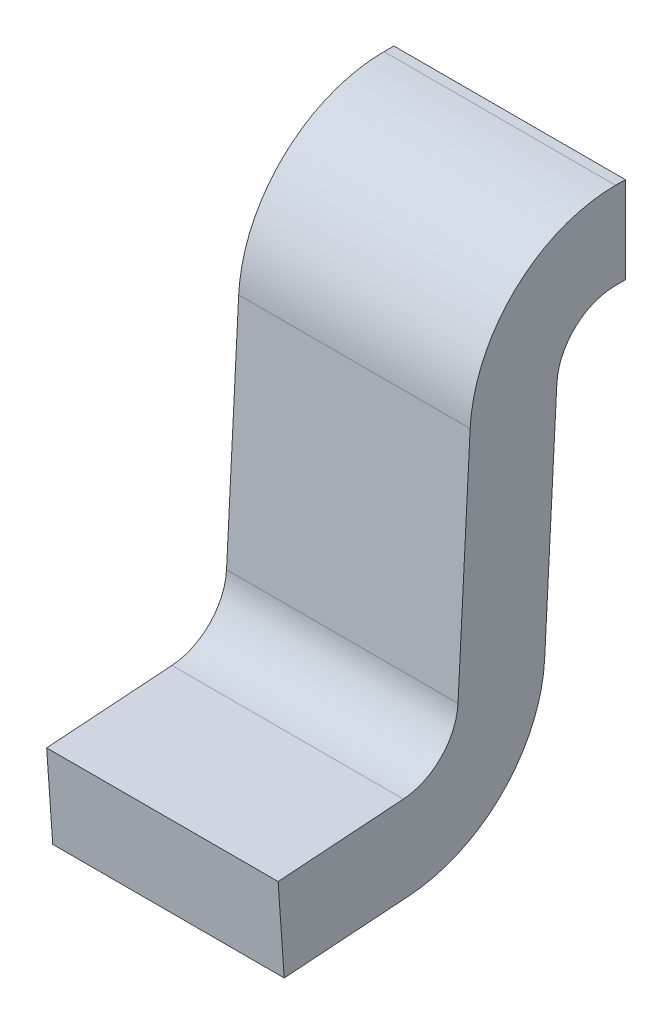
ISO-10303-21;
HEADER;
FILE_DESCRIPTION(('STEP AP214'),'2;1');
FILE_NAME('part.step','',(''),(''),'','','');
FILE_SCHEMA(('AUTOMOTIVE_DESIGN { 1 0 10303 214 1 1 1 1 }'));
ENDSEC;
DATA;
#1=APPLICATION_CONTEXT('core data for automotive mechanical design processes');
#2=APPLICATION_PROTOCOL_DEFINITION('international standard','automotive_design',2000,#1);
#3=PRODUCT_CONTEXT('',#1,'mechanical');
#4=PRODUCT('Part','Part','',(#3));
#5=PRODUCT_RELATED_PRODUCT_CATEGORY('part','',(#4));
#6=PRODUCT_DEFINITION_FORMATION('','',#4);
#7=PRODUCT_DEFINITION_CONTEXT('part definition',#1,'design');
#8=PRODUCT_DEFINITION('design','',#6,#7);
#9=PRODUCT_DEFINITION_SHAPE('','',#8);
#10=(LENGTH_UNIT() NAMED_UNIT(*) SI_UNIT(.MILLI.,.METRE.));
#11=(NAMED_UNIT(*) PLANE_ANGLE_UNIT() SI_UNIT($,.RADIAN.));
#12=(NAMED_UNIT(*) SI_UNIT($,.STERADIAN.) SOLID_ANGLE_UNIT());
#13=UNCERTAINTY_MEASURE_WITH_UNIT(LENGTH_MEASURE(1.E-05),#10,'distance_accuracy_value','');
#14=(GEOMETRIC_REPRESENTATION_CONTEXT(3) GLOBAL_UNCERTAINTY_ASSIGNED_CONTEXT((#13)) GLOBAL_UNIT_ASSIGNED_CONTEXT((#10,
#11,#12)) REPRESENTATION_CONTEXT('',''));
#15=CARTESIAN_POINT('',(0.,0.,0.));
#16=DIRECTION('',(0.,0.,1.));
#17=DIRECTION('',(1.,0.,0.));
#18=AXIS2_PLACEMENT_3D('',#15,#16,#17);
#19=CARTESIAN_POINT('',(-0.2,0.01612280193581,0.251100322008));
#20=DIRECTION('',(-1.,0.,0.));
#21=DIRECTION('',(0.,-0.0523359562429177,-0.998629534754575));
#22=AXIS2_PLACEMENT_3D('',#19,#20,#21);
#23=CYLINDRICAL_SURFACE('',#22,0.2516);
#24=CARTESIAN_POINT('',(0.2,0.01612280193581,0.251100322008));
#25=DIRECTION('',(-1.,0.,0.));
#26=DIRECTION('',(0.,-0.0523359562429177,-0.998629534754575));
#27=AXIS2_PLACEMENT_3D('',#24,#25,#26);
#28=CIRCLE('',#27,0.2516);
#29=CARTESIAN_POINT('',(0.2,0.002955075345083,-0.0001548689364499));
#30=VERTEX_POINT('',#29);
#31=CARTESIAN_POINT('',(0.2,-0.23486431311,0.233549593214));
#32=VERTEX_POINT('',#31);
#33=EDGE_CURVE('E194',#30,#32,#28,.T.);
#34=ORIENTED_EDGE('',*,*,#33,.T.);
#35=DIRECTION('',(1.,0.,0.));
#36=VECTOR('',#35,1.);
#37=CARTESIAN_POINT('',(-0.2,-0.23486431311,0.233549593214));
#38=LINE('',#37,#36);
#39=CARTESIAN_POINT('',(-0.2,-0.23486431311,0.233549593214));
#40=VERTEX_POINT('',#39);
#41=EDGE_CURVE('E11',#40,#32,#38,.T.);
#42=ORIENTED_EDGE('',*,*,#41,.F.);
#43=CARTESIAN_POINT('',(-0.2,0.01612280193581,0.251100322008));
#44=DIRECTION('',(-1.,0.,0.));
#45=DIRECTION('',(0.,-0.0523359562429177,-0.998629534754575));
#46=AXIS2_PLACEMENT_3D('',#43,#44,#45);
#47=CIRCLE('',#46,0.2516);
#48=CARTESIAN_POINT('',(-0.2,0.002955075345083,-0.0001548689364499));
#49=VERTEX_POINT('',#48);
#50=EDGE_CURVE('E157',#49,#40,#47,.T.);
#51=ORIENTED_EDGE('',*,*,#50,.F.);
#52=DIRECTION('',(1.,0.,0.));
#53=VECTOR('',#52,1.);
#54=CARTESIAN_POINT('',(-0.2,0.002955075345083,-0.0001548689364499));
#55=LINE('',#54,#53);
#56=EDGE_CURVE('E139',#49,#30,#55,.T.);
#57=ORIENTED_EDGE('',*,*,#56,.T.);
#58=EDGE_LOOP('',(#34,#42,#51,#57));
#59=FACE_BOUND('',#58,.T.);
#60=ADVANCED_FACE('F17',(#59),#23,.T.);
#61=CARTESIAN_POINT('',(-0.2,-0.25,0.45));
#62=DIRECTION('',(0.,-0.997564050259825,-0.0697564737441177));
#63=DIRECTION('',(0.,0.0697564737441177,-0.997564050259825));
#64=AXIS2_PLACEMENT_3D('',#61,#62,#63);
#65=PLANE('',#64);
#66=ORIENTED_EDGE('',*,*,#41,.T.);
#67=DIRECTION('',(0.,0.0697564737441177,-0.997564050259825));
#68=VECTOR('',#67,1.);
#69=CARTESIAN_POINT('',(0.2,-0.25,0.45));
#70=LINE('',#69,#68);
#71=CARTESIAN_POINT('',(0.2,-0.25,0.45));
#72=VERTEX_POINT('',#71);
#73=EDGE_CURVE('E198',#72,#32,#70,.T.);
#74=ORIENTED_EDGE('',*,*,#73,.F.);
#75=DIRECTION('',(1.,0.,0.));
#76=VECTOR('',#75,1.);
#77=CARTESIAN_POINT('',(-0.2,-0.25,0.45));
#78=LINE('',#77,#76);
#79=CARTESIAN_POINT('',(-0.2,-0.25,0.45));
#80=VERTEX_POINT('',#79);
#81=EDGE_CURVE('E26',#80,#72,#78,.T.);
#82=ORIENTED_EDGE('',*,*,#81,.F.);
#83=DIRECTION('',(0.,0.0697564737441177,-0.997564050259825));
#84=VECTOR('',#83,1.);
#85=CARTESIAN_POINT('',(-0.2,-0.25,0.45));
#86=LINE('',#85,#84);
#87=EDGE_CURVE('E165',#80,#40,#86,.T.);
#88=ORIENTED_EDGE('',*,*,#87,.T.);
#89=EDGE_LOOP('',(#66,#74,#82,#88));
#90=FACE_BOUND('',#89,.T.);
#91=ADVANCED_FACE('F295',(#90),#65,.T.);
#92=CARTESIAN_POINT('',(-0.2,-0.100365392461,0.460463471062));
#93=DIRECTION('',(0.,-0.0697564737441177,0.997564050259825));
#94=DIRECTION('',(-1.,0.,0.));
#95=AXIS2_PLACEMENT_3D('',#92,#93,#94);
#96=PLANE('',#95);
#97=ORIENTED_EDGE('',*,*,#81,.T.);
#98=DIRECTION('',(0.,-0.997564050259825,-0.0697564737441177));
#99=VECTOR('',#98,1.);
#100=CARTESIAN_POINT('',(0.2,-0.100365392461,0.460463471062));
#101=LINE('',#100,#99);
#102=CARTESIAN_POINT('',(0.2,-0.100365392461,0.460463471062));
#103=VERTEX_POINT('',#102);
#104=EDGE_CURVE('E227',#103,#72,#101,.T.);
#105=ORIENTED_EDGE('',*,*,#104,.F.);
#106=DIRECTION('',(1.,0.,0.));
#107=VECTOR('',#106,1.);
#108=CARTESIAN_POINT('',(-0.2,-0.100365392461,0.460463471062));
#109=LINE('',#108,#107);
#110=CARTESIAN_POINT('',(-0.2,-0.100365392461,0.460463471062));
#111=VERTEX_POINT('',#110);
#112=EDGE_CURVE('E20',#111,#103,#109,.T.);
#113=ORIENTED_EDGE('',*,*,#112,.F.);
#114=DIRECTION('',(0.,-0.997564050259825,-0.0697564737441177));
#115=VECTOR('',#114,1.);
#116=CARTESIAN_POINT('',(-0.2,-0.100365392461,0.460463471062));
#117=LINE('',#116,#115);
#118=EDGE_CURVE('E171',#111,#80,#117,.T.);
#119=ORIENTED_EDGE('',*,*,#118,.T.);
#120=EDGE_LOOP('',(#97,#105,#113,#119));
#121=FACE_BOUND('',#120,.T.);
#122=ADVANCED_FACE('F285',(#121),#96,.T.);
#123=CARTESIAN_POINT('',(-0.2,-0.07895942959831,0.154343940258));
#124=DIRECTION('',(0.,0.997564050259825,0.0697564737441177));
#125=DIRECTION('',(1.,0.,0.));
#126=AXIS2_PLACEMENT_3D('',#123,#124,#125);
#127=PLANE('',#126);
#128=ORIENTED_EDGE('',*,*,#112,.T.);
#129=DIRECTION('',(0.,-0.0697564737441177,0.997564050259825));
#130=VECTOR('',#129,1.);
#131=CARTESIAN_POINT('',(0.2,-0.08522970557059,0.244013064275));
#132=LINE('',#131,#130);
#133=CARTESIAN_POINT('',(0.2,-0.08522970557059,0.244013064275));
#134=VERTEX_POINT('',#133);
#135=EDGE_CURVE('E231',#134,#103,#132,.T.);
#136=ORIENTED_EDGE('',*,*,#135,.F.);
#137=DIRECTION('',(1.,0.,0.));
#138=VECTOR('',#137,1.);
#139=CARTESIAN_POINT('',(-0.2,-0.08522970557059,0.244013064275));
#140=LINE('',#139,#138);
#141=CARTESIAN_POINT('',(-0.2,-0.08522970557059,0.244013064275));
#142=VERTEX_POINT('',#141);
#143=EDGE_CURVE('E205',#142,#134,#140,.T.);
#144=ORIENTED_EDGE('',*,*,#143,.F.);
#145=DIRECTION('',(0.,-0.0697564737441177,0.997564050259825));
#146=VECTOR('',#145,1.);
#147=CARTESIAN_POINT('',(-0.2,-0.08522970557059,0.244013064275));
#148=LINE('',#147,#146);
#149=EDGE_CURVE('E174',#142,#111,#148,.T.);
#150=ORIENTED_EDGE('',*,*,#149,.T.);
#151=EDGE_LOOP('',(#128,#136,#144,#150));
#152=FACE_BOUND('',#151,.T.);
#153=ADVANCED_FACE('F280',(#152),#127,.T.);
#154=CARTESIAN_POINT('',(-0.2,0.01612280193581,0.251100322008));
#155=DIRECTION('',(1.,0.,0.));
#156=DIRECTION('',(0.,-0.997564050259826,-0.0697564737441078));
#157=AXIS2_PLACEMENT_3D('',#154,#155,#156);
#158=CYLINDRICAL_SURFACE('',#157,0.1016);
#159=CARTESIAN_POINT('',(0.2,0.01612280193581,0.251100322008));
#160=DIRECTION('',(1.,0.,0.));
#161=DIRECTION('',(0.,-0.997564050259825,-0.0697564737441177));
#162=AXIS2_PLACEMENT_3D('',#159,#160,#161);
#163=CIRCLE('',#162,0.1016);
#164=CARTESIAN_POINT('',(0.2,0.01080546878153,0.149639561277));
#165=VERTEX_POINT('',#164);
#166=EDGE_CURVE('E223',#134,#165,#163,.T.);
#167=ORIENTED_EDGE('',*,*,#166,.T.);
#168=DIRECTION('',(1.,0.,0.));
#169=VECTOR('',#168,1.);
#170=CARTESIAN_POINT('',(-0.2,0.01080546878153,0.149639561277));
#171=LINE('',#170,#169);
#172=CARTESIAN_POINT('',(-0.2,0.01080546878153,0.149639561277));
#173=VERTEX_POINT('',#172);
#174=EDGE_CURVE('E218',#173,#165,#171,.T.);
#175=ORIENTED_EDGE('',*,*,#174,.F.);
#176=CARTESIAN_POINT('',(-0.2,0.01612280193581,0.251100322008));
#177=DIRECTION('',(1.,0.,0.));
#178=DIRECTION('',(0.,-0.997564050259825,-0.0697564737441177));
#179=AXIS2_PLACEMENT_3D('',#176,#177,#178);
#180=CIRCLE('',#179,0.1016);
#181=EDGE_CURVE('E178',#142,#173,#180,.T.);
#182=ORIENTED_EDGE('',*,*,#181,.F.);
#183=ORIENTED_EDGE('',*,*,#143,.T.);
#184=EDGE_LOOP('',(#167,#175,#182,#183));
#185=FACE_BOUND('',#184,.T.);
#186=ADVANCED_FACE('F290',(#185),#158,.F.);
#187=CARTESIAN_POINT('',(-0.2,0.3984,-0.12261868962));
#188=DIRECTION('',(1.,0.,0.));
#189=DIRECTION('',(0.,1.,0.));
#190=AXIS2_PLACEMENT_3D('',#187,#188,#189);
#191=CYLINDRICAL_SURFACE('',#190,0.1016);
#192=CARTESIAN_POINT('',(0.2,0.3984,-0.12261868962));
#193=DIRECTION('',(1.,0.,0.));
#194=DIRECTION('',(0.,1.,0.));
#195=AXIS2_PLACEMENT_3D('',#192,#193,#194);
#196=CIRCLE('',#195,0.1016);
#197=CARTESIAN_POINT('',(0.2,0.5,-0.12261868962));
#198=VERTEX_POINT('',#197);
#199=CARTESIAN_POINT('',(0.2,0.403717333154,-0.02115792888869));
#200=VERTEX_POINT('',#199);
#201=EDGE_CURVE('E197',#198,#200,#196,.T.);
#202=ORIENTED_EDGE('',*,*,#201,.T.);
#203=DIRECTION('',(1.,0.,0.));
#204=VECTOR('',#203,1.);
#205=CARTESIAN_POINT('',(-0.2,0.403717333154,-0.02115792888869));
#206=LINE('',#205,#204);
#207=CARTESIAN_POINT('',(-0.2,0.403717333154,-0.02115792888869));
#208=VERTEX_POINT('',#207);
#209=EDGE_CURVE('E151',#208,#200,#206,.T.);
#210=ORIENTED_EDGE('',*,*,#209,.F.);
#211=CARTESIAN_POINT('',(-0.2,0.3984,-0.12261868962));
#212=DIRECTION('',(1.,0.,0.));
#213=DIRECTION('',(0.,1.,0.));
#214=AXIS2_PLACEMENT_3D('',#211,#212,#213);
#215=CIRCLE('',#214,0.1016);
#216=CARTESIAN_POINT('',(-0.2,0.5,-0.12261868962));
#217=VERTEX_POINT('',#216);
#218=EDGE_CURVE('E160',#217,#208,#215,.T.);
#219=ORIENTED_EDGE('',*,*,#218,.F.);
#220=DIRECTION('',(1.,0.,0.));
#221=VECTOR('',#220,1.);
#222=CARTESIAN_POINT('',(-0.2,0.5,-0.12261868962));
#223=LINE('',#222,#221);
#224=EDGE_CURVE('E202',#217,#198,#223,.T.);
#225=ORIENTED_EDGE('',*,*,#224,.T.);
#226=EDGE_LOOP('',(#202,#210,#219,#225));
#227=FACE_BOUND('',#226,.T.);
#228=ADVANCED_FACE('F298',(#227),#191,.F.);
#229=CARTESIAN_POINT('',(-0.2,0.5,-0.02620388964152));
#230=DIRECTION('',(0.,-1.,0.));
#231=DIRECTION('',(0.,0.,-1.));
#232=AXIS2_PLACEMENT_3D('',#229,#230,#231);
#233=PLANE('',#232);
#234=DIRECTION('',(1.,0.,0.));
#235=VECTOR('',#234,1.);
#236=CARTESIAN_POINT('',(-0.2,0.5,-0.139536528938));
#237=LINE('',#236,#235);
#238=CARTESIAN_POINT('',(-0.2,0.5,-0.139536528938));
#239=VERTEX_POINT('',#238);
#240=CARTESIAN_POINT('',(0.2,0.5,-0.139536528938));
#241=VERTEX_POINT('',#240);
#242=EDGE_CURVE('E206',#239,#241,#237,.T.);
#243=ORIENTED_EDGE('',*,*,#242,.T.);
#244=DIRECTION('',(0.,0.,-1.));
#245=VECTOR('',#244,1.);
#246=CARTESIAN_POINT('',(0.2,0.5,-0.12261868962));
#247=LINE('',#246,#245);
#248=EDGE_CURVE('E240',#198,#241,#247,.T.);
#249=ORIENTED_EDGE('',*,*,#248,.F.);
#250=ORIENTED_EDGE('',*,*,#224,.F.);
#251=DIRECTION('',(0.,0.,-1.));
#252=VECTOR('',#251,1.);
#253=CARTESIAN_POINT('',(-0.2,0.5,-0.12261868962));
#254=LINE('',#253,#252);
#255=EDGE_CURVE('E210',#217,#239,#254,.T.);
#256=ORIENTED_EDGE('',*,*,#255,.T.);
#257=EDGE_LOOP('',(#243,#249,#250,#256));
#258=FACE_BOUND('',#257,.T.);
#259=ADVANCED_FACE('F301',(#258),#233,.T.);
#260=CARTESIAN_POINT('',(-0.2,0.5,-0.139536528938));
#261=DIRECTION('',(0.,0.,-1.));
#262=DIRECTION('',(0.,-1.,0.));
#263=AXIS2_PLACEMENT_3D('',#260,#261,#262);
#264=PLANE('',#263);
#265=DIRECTION('',(1.,0.,0.));
#266=VECTOR('',#265,1.);
#267=CARTESIAN_POINT('',(-0.2,0.65,-0.139536528938));
#268=LINE('',#267,#266);
#269=CARTESIAN_POINT('',(-0.2,0.65,-0.139536528938));
#270=VERTEX_POINT('',#269);
#271=CARTESIAN_POINT('',(0.2,0.65,-0.139536528938));
#272=VERTEX_POINT('',#271);
#273=EDGE_CURVE('E243',#270,#272,#268,.T.);
#274=ORIENTED_EDGE('',*,*,#273,.T.);
#275=DIRECTION('',(0.,1.,0.));
#276=VECTOR('',#275,1.);
#277=CARTESIAN_POINT('',(0.2,0.5,-0.139536528938));
#278=LINE('',#277,#276);
#279=EDGE_CURVE('E247',#241,#272,#278,.T.);
#280=ORIENTED_EDGE('',*,*,#279,.F.);
#281=ORIENTED_EDGE('',*,*,#242,.F.);
#282=DIRECTION('',(0.,1.,0.));
#283=VECTOR('',#282,1.);
#284=CARTESIAN_POINT('',(-0.2,0.5,-0.139536528938));
#285=LINE('',#284,#283);
#286=EDGE_CURVE('E201',#239,#270,#285,.T.);
#287=ORIENTED_EDGE('',*,*,#286,.T.);
#288=EDGE_LOOP('',(#274,#280,#281,#287));
#289=FACE_BOUND('',#288,.T.);
#290=ADVANCED_FACE('F304',(#289),#264,.T.);
#291=CARTESIAN_POINT('',(-0.2,0.65,-0.139536528938));
#292=DIRECTION('',(0.,1.,0.));
#293=DIRECTION('',(1.,0.,0.));
#294=AXIS2_PLACEMENT_3D('',#291,#292,#293);
#295=PLANE('',#294);
#296=DIRECTION('',(1.,0.,0.));
#297=VECTOR('',#296,1.);
#298=CARTESIAN_POINT('',(-0.2,0.65,-0.12261868962));
#299=LINE('',#298,#297);
#300=CARTESIAN_POINT('',(-0.2,0.65,-0.12261868962));
#301=VERTEX_POINT('',#300);
#302=CARTESIAN_POINT('',(0.2,0.65,-0.12261868962));
#303=VERTEX_POINT('',#302);
#304=EDGE_CURVE('E49',#301,#303,#299,.T.);
#305=ORIENTED_EDGE('',*,*,#304,.T.);
#306=DIRECTION('',(0.,0.,1.));
#307=VECTOR('',#306,1.);
#308=CARTESIAN_POINT('',(0.2,0.65,-0.139536528938));
#309=LINE('',#308,#307);
#310=EDGE_CURVE('E251',#272,#303,#309,.T.);
#311=ORIENTED_EDGE('',*,*,#310,.F.);
#312=ORIENTED_EDGE('',*,*,#273,.F.);
#313=DIRECTION('',(0.,0.,1.));
#314=VECTOR('',#313,1.);
#315=CARTESIAN_POINT('',(-0.2,0.65,-0.139536528938));
#316=LINE('',#315,#314);
#317=EDGE_CURVE('E193',#270,#301,#316,.T.);
#318=ORIENTED_EDGE('',*,*,#317,.T.);
#319=EDGE_LOOP('',(#305,#311,#312,#318));
#320=FACE_BOUND('',#319,.T.);
#321=ADVANCED_FACE('F307',(#320),#295,.T.);
#322=CARTESIAN_POINT('',(-0.2,0.3984,-0.12261868962));
#323=DIRECTION('',(-1.,0.,0.));
#324=DIRECTION('',(0.,0.0523359562429177,0.998629534754575));
#325=AXIS2_PLACEMENT_3D('',#322,#323,#324);
#326=CYLINDRICAL_SURFACE('',#325,0.2516);
#327=CARTESIAN_POINT('',(0.2,0.3984,-0.12261868962));
#328=DIRECTION('',(-1.,0.,0.));
#329=DIRECTION('',(0.,0.0523359562429177,0.998629534754575));
#330=AXIS2_PLACEMENT_3D('',#327,#328,#329);
#331=CIRCLE('',#330,0.2516);
#332=CARTESIAN_POINT('',(0.2,0.411567726591,0.128636501324));
#333=VERTEX_POINT('',#332);
#334=EDGE_CURVE('E255',#333,#303,#331,.T.);
#335=ORIENTED_EDGE('',*,*,#334,.T.);
#336=ORIENTED_EDGE('',*,*,#304,.F.);
#337=CARTESIAN_POINT('',(-0.2,0.3984,-0.12261868962));
#338=DIRECTION('',(-1.,0.,0.));
#339=DIRECTION('',(0.,0.0523359562429177,0.998629534754575));
#340=AXIS2_PLACEMENT_3D('',#337,#338,#339);
#341=CIRCLE('',#340,0.2516);
#342=CARTESIAN_POINT('',(-0.2,0.411567726591,0.128636501324));
#343=VERTEX_POINT('',#342);
#344=EDGE_CURVE('E186',#343,#301,#341,.T.);
#345=ORIENTED_EDGE('',*,*,#344,.F.);
#346=DIRECTION('',(1.,0.,0.));
#347=VECTOR('',#346,1.);
#348=CARTESIAN_POINT('',(-0.2,0.411567726591,0.128636501324));
#349=LINE('',#348,#347);
#350=EDGE_CURVE('E39',#343,#333,#349,.T.);
#351=ORIENTED_EDGE('',*,*,#350,.T.);
#352=EDGE_LOOP('',(#335,#336,#345,#351));
#353=FACE_BOUND('',#352,.T.);
#354=ADVANCED_FACE('F309',(#353),#326,.T.);
#355=CARTESIAN_POINT('',(-0.2,0.007850393436442,0.149794430213));
#356=DIRECTION('',(0.,0.0523359562429177,0.998629534754575));
#357=DIRECTION('',(1.,0.,0.));
#358=AXIS2_PLACEMENT_3D('',#355,#356,#357);
#359=PLANE('',#358);
#360=ORIENTED_EDGE('',*,*,#174,.T.);
#361=DIRECTION('',(0.,-0.998629534754575,0.0523359562429177));
#362=VECTOR('',#361,1.);
#363=CARTESIAN_POINT('',(0.2,0.411567726591,0.128636501324));
#364=LINE('',#363,#362);
#365=EDGE_CURVE('E258',#333,#165,#364,.T.);
#366=ORIENTED_EDGE('',*,*,#365,.F.);
#367=ORIENTED_EDGE('',*,*,#350,.F.);
#368=DIRECTION('',(0.,0.998629534754575,-0.0523359562429177));
#369=VECTOR('',#368,1.);
#370=CARTESIAN_POINT('',(-0.2,0.01080546878153,0.149639561277));
#371=LINE('',#370,#369);
#372=EDGE_CURVE('E182',#173,#343,#371,.T.);
#373=ORIENTED_EDGE('',*,*,#372,.F.);
#374=EDGE_LOOP('',(#360,#366,#367,#373));
#375=FACE_BOUND('',#374,.T.);
#376=ADVANCED_FACE('F293',(#375),#359,.T.);
#377=CARTESIAN_POINT('',(0.2,0.,0.));
#378=DIRECTION('',(1.,0.,0.));
#379=DIRECTION('',(0.,1.,0.));
#380=AXIS2_PLACEMENT_3D('',#377,#378,#379);
#381=PLANE('',#380);
#382=ORIENTED_EDGE('',*,*,#166,.F.);
#383=ORIENTED_EDGE('',*,*,#135,.T.);
#384=ORIENTED_EDGE('',*,*,#104,.T.);
#385=ORIENTED_EDGE('',*,*,#73,.T.);
#386=ORIENTED_EDGE('',*,*,#33,.F.);
#387=DIRECTION('',(0.,0.998629534754575,-0.0523359562429177));
#388=VECTOR('',#387,1.);
#389=CARTESIAN_POINT('',(0.2,0.002955075345083,-0.0001548689364499));
#390=LINE('',#389,#388);
#391=EDGE_CURVE('E146',#30,#200,#390,.T.);
#392=ORIENTED_EDGE('',*,*,#391,.T.);
#393=ORIENTED_EDGE('',*,*,#201,.F.);
#394=ORIENTED_EDGE('',*,*,#248,.T.);
#395=ORIENTED_EDGE('',*,*,#279,.T.);
#396=ORIENTED_EDGE('',*,*,#310,.T.);
#397=ORIENTED_EDGE('',*,*,#334,.F.);
#398=ORIENTED_EDGE('',*,*,#365,.T.);
#399=EDGE_LOOP('',(#382,#383,#384,#385,#386,#392,#393,#394,#395,#396,#397,#398));
#400=FACE_BOUND('',#399,.T.);
#401=ADVANCED_FACE('F288',(#400),#381,.T.);
#402=CARTESIAN_POINT('',(-0.2,-0.219336739934,0.01149495145513));
#403=DIRECTION('',(0.,-0.0523359562429177,-0.998629534754575));
#404=DIRECTION('',(0.,-0.998629534754575,0.0523359562429177));
#405=AXIS2_PLACEMENT_3D('',#402,#403,#404);
#406=PLANE('',#405);
#407=ORIENTED_EDGE('',*,*,#56,.F.);
#408=DIRECTION('',(0.,-0.998629534754575,0.0523359562429177));
#409=VECTOR('',#408,1.);
#410=CARTESIAN_POINT('',(-0.2,0.403717333154,-0.02115792888869));
#411=LINE('',#410,#409);
#412=EDGE_CURVE('E143',#208,#49,#411,.T.);
#413=ORIENTED_EDGE('',*,*,#412,.F.);
#414=ORIENTED_EDGE('',*,*,#209,.T.);
#415=ORIENTED_EDGE('',*,*,#391,.F.);
#416=EDGE_LOOP('',(#407,#413,#414,#415));
#417=FACE_BOUND('',#416,.T.);
#418=ADVANCED_FACE('F141',(#417),#406,.T.);
#419=CARTESIAN_POINT('',(-0.2,0.,0.));
#420=DIRECTION('',(1.,0.,0.));
#421=DIRECTION('',(0.,1.,0.));
#422=AXIS2_PLACEMENT_3D('',#419,#420,#421);
#423=PLANE('',#422);
#424=ORIENTED_EDGE('',*,*,#50,.T.);
#425=ORIENTED_EDGE('',*,*,#87,.F.);
#426=ORIENTED_EDGE('',*,*,#118,.F.);
#427=ORIENTED_EDGE('',*,*,#149,.F.);
#428=ORIENTED_EDGE('',*,*,#181,.T.);
#429=ORIENTED_EDGE('',*,*,#372,.T.);
#430=ORIENTED_EDGE('',*,*,#344,.T.);
#431=ORIENTED_EDGE('',*,*,#317,.F.);
#432=ORIENTED_EDGE('',*,*,#286,.F.);
#433=ORIENTED_EDGE('',*,*,#255,.F.);
#434=ORIENTED_EDGE('',*,*,#218,.T.);
#435=ORIENTED_EDGE('',*,*,#412,.T.);
#436=EDGE_LOOP('',(#424,#425,#426,#427,#428,#429,#430,#431,#432,#433,#434,#435));
#437=FACE_BOUND('',#436,.T.);
#438=ADVANCED_FACE('F155',(#437),#423,.F.);
#439=CLOSED_SHELL('',(#60,#91,#122,#153,#186,#228,#259,#290,#321,#354,#376,#401,#418,#438));
#440=MANIFOLD_SOLID_BREP('B1',#439);
#441=ADVANCED_BREP_SHAPE_REPRESENTATION('',(#18,#440),#14);
#442=SHAPE_DEFINITION_REPRESENTATION(#9,#441);
ENDSEC;
END-ISO-10303-21;
